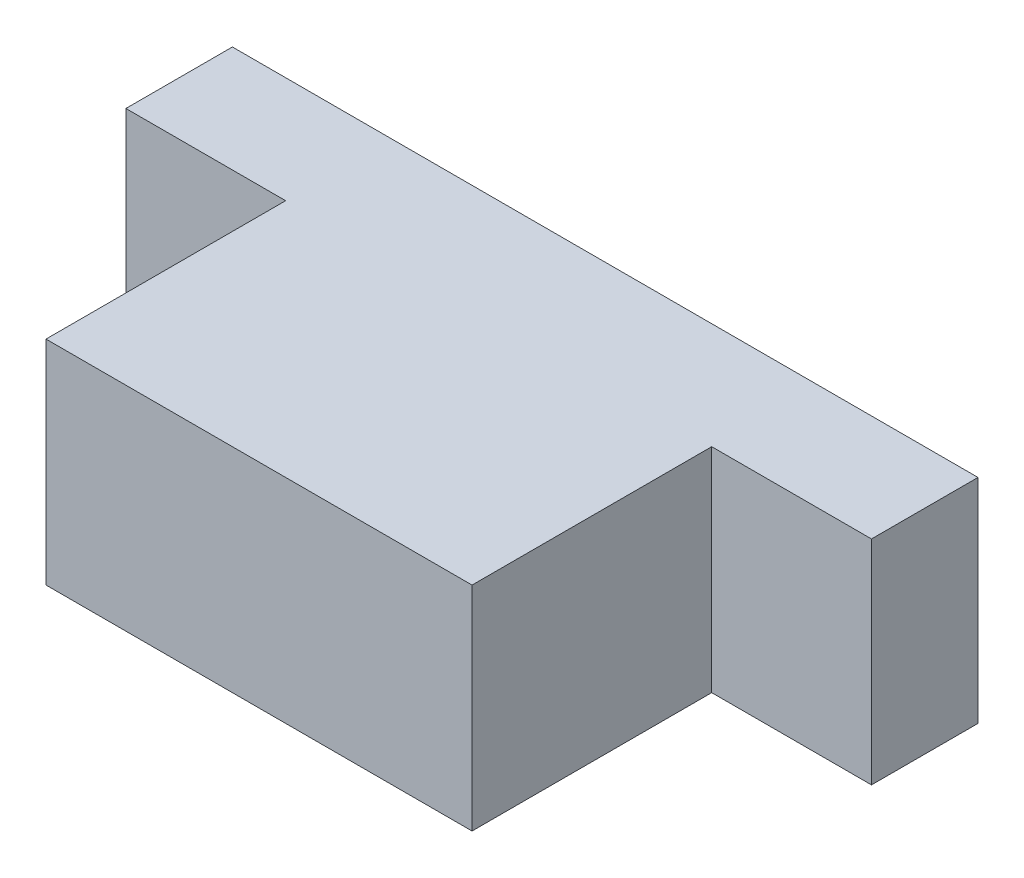
ISO-10303-21;
HEADER;
FILE_DESCRIPTION(('STEP AP214'),'2;1');
FILE_NAME('part.step','',(''),(''),'','','');
FILE_SCHEMA(('AUTOMOTIVE_DESIGN { 1 0 10303 214 1 1 1 1 }'));
ENDSEC;
DATA;
#1=APPLICATION_CONTEXT('core data for automotive mechanical design processes');
#2=APPLICATION_PROTOCOL_DEFINITION('international standard','automotive_design',2000,#1);
#3=PRODUCT_CONTEXT('',#1,'mechanical');
#4=PRODUCT('Part','Part','',(#3));
#5=PRODUCT_RELATED_PRODUCT_CATEGORY('part','',(#4));
#6=PRODUCT_DEFINITION_FORMATION('','',#4);
#7=PRODUCT_DEFINITION_CONTEXT('part definition',#1,'design');
#8=PRODUCT_DEFINITION('design','',#6,#7);
#9=PRODUCT_DEFINITION_SHAPE('','',#8);
#10=(LENGTH_UNIT() NAMED_UNIT(*) SI_UNIT(.MILLI.,.METRE.));
#11=(NAMED_UNIT(*) PLANE_ANGLE_UNIT() SI_UNIT($,.RADIAN.));
#12=(NAMED_UNIT(*) SI_UNIT($,.STERADIAN.) SOLID_ANGLE_UNIT());
#13=UNCERTAINTY_MEASURE_WITH_UNIT(LENGTH_MEASURE(1.E-05),#10,'distance_accuracy_value','');
#14=(GEOMETRIC_REPRESENTATION_CONTEXT(3) GLOBAL_UNCERTAINTY_ASSIGNED_CONTEXT((#13)) GLOBAL_UNIT_ASSIGNED_CONTEXT((#10,
#11,#12)) REPRESENTATION_CONTEXT('',''));
#15=CARTESIAN_POINT('',(0.,0.,0.));
#16=DIRECTION('',(0.,0.,1.));
#17=DIRECTION('',(1.,0.,0.));
#18=AXIS2_PLACEMENT_3D('',#15,#16,#17);
#19=CARTESIAN_POINT('',(20.,-10.,22.5));
#20=DIRECTION('',(-1.,0.,0.));
#21=DIRECTION('',(0.,0.,1.));
#22=AXIS2_PLACEMENT_3D('',#19,#20,#21);
#23=PLANE('',#22);
#24=DIRECTION('',(0.,1.,0.));
#25=VECTOR('',#24,1.);
#26=CARTESIAN_POINT('',(20.,-10.,0.));
#27=LINE('',#26,#25);
#28=CARTESIAN_POINT('',(20.,-10.,0.));
#29=VERTEX_POINT('',#28);
#30=CARTESIAN_POINT('',(20.,10.,0.));
#31=VERTEX_POINT('',#30);
#32=EDGE_CURVE('E122',#29,#31,#27,.T.);
#33=ORIENTED_EDGE('',*,*,#32,.T.);
#34=DIRECTION('',(0.,0.,-1.));
#35=VECTOR('',#34,1.);
#36=CARTESIAN_POINT('',(20.,10.,22.5));
#37=LINE('',#36,#35);
#38=CARTESIAN_POINT('',(20.,10.,22.5));
#39=VERTEX_POINT('',#38);
#40=EDGE_CURVE('E11',#39,#31,#37,.T.);
#41=ORIENTED_EDGE('',*,*,#40,.F.);
#42=DIRECTION('',(0.,1.,0.));
#43=VECTOR('',#42,1.);
#44=CARTESIAN_POINT('',(20.,-10.,22.5));
#45=LINE('',#44,#43);
#46=CARTESIAN_POINT('',(20.,-10.,22.5));
#47=VERTEX_POINT('',#46);
#48=EDGE_CURVE('E131',#47,#39,#45,.T.);
#49=ORIENTED_EDGE('',*,*,#48,.F.);
#50=DIRECTION('',(0.,0.,-1.));
#51=VECTOR('',#50,1.);
#52=CARTESIAN_POINT('',(20.,-10.,22.5));
#53=LINE('',#52,#51);
#54=EDGE_CURVE('E137',#47,#29,#53,.T.);
#55=ORIENTED_EDGE('',*,*,#54,.T.);
#56=EDGE_LOOP('',(#33,#41,#49,#55));
#57=FACE_BOUND('',#56,.T.);
#58=ADVANCED_FACE('F36',(#57),#23,.F.);
#59=CARTESIAN_POINT('',(-20.,10.,22.5));
#60=DIRECTION('',(0.,-1.,0.));
#61=DIRECTION('',(0.,0.,-1.));
#62=AXIS2_PLACEMENT_3D('',#59,#60,#61);
#63=PLANE('',#62);
#64=ORIENTED_EDGE('',*,*,#40,.T.);
#65=DIRECTION('',(1.,0.,0.));
#66=VECTOR('',#65,1.);
#67=CARTESIAN_POINT('',(35.,10.,0.));
#68=LINE('',#67,#66);
#69=CARTESIAN_POINT('',(35.,10.,0.));
#70=VERTEX_POINT('',#69);
#71=EDGE_CURVE('E154',#31,#70,#68,.T.);
#72=ORIENTED_EDGE('',*,*,#71,.T.);
#73=DIRECTION('',(0.,0.,1.));
#74=VECTOR('',#73,1.);
#75=CARTESIAN_POINT('',(35.,10.,-10.));
#76=LINE('',#75,#74);
#77=CARTESIAN_POINT('',(35.,10.,-10.));
#78=VERTEX_POINT('',#77);
#79=EDGE_CURVE('E104',#78,#70,#76,.T.);
#80=ORIENTED_EDGE('',*,*,#79,.F.);
#81=DIRECTION('',(1.,0.,0.));
#82=VECTOR('',#81,1.);
#83=CARTESIAN_POINT('',(35.,10.,-10.));
#84=LINE('',#83,#82);
#85=CARTESIAN_POINT('',(-35.,10.,-10.));
#86=VERTEX_POINT('',#85);
#87=EDGE_CURVE('E96',#86,#78,#84,.T.);
#88=ORIENTED_EDGE('',*,*,#87,.F.);
#89=DIRECTION('',(0.,0.,1.));
#90=VECTOR('',#89,1.);
#91=CARTESIAN_POINT('',(-35.,10.,-10.));
#92=LINE('',#91,#90);
#93=CARTESIAN_POINT('',(-35.,10.,0.));
#94=VERTEX_POINT('',#93);
#95=EDGE_CURVE('E101',#86,#94,#92,.T.);
#96=ORIENTED_EDGE('',*,*,#95,.T.);
#97=CARTESIAN_POINT('',(-20.,10.,0.));
#98=VERTEX_POINT('',#97);
#99=EDGE_CURVE('E151',#94,#98,#68,.T.);
#100=ORIENTED_EDGE('',*,*,#99,.T.);
#101=DIRECTION('',(0.,0.,-1.));
#102=VECTOR('',#101,1.);
#103=CARTESIAN_POINT('',(-20.,10.,22.5));
#104=LINE('',#103,#102);
#105=CARTESIAN_POINT('',(-20.,10.,22.5));
#106=VERTEX_POINT('',#105);
#107=EDGE_CURVE('E44',#106,#98,#104,.T.);
#108=ORIENTED_EDGE('',*,*,#107,.F.);
#109=DIRECTION('',(-1.,0.,0.));
#110=VECTOR('',#109,1.);
#111=CARTESIAN_POINT('',(-20.,10.,22.5));
#112=LINE('',#111,#110);
#113=EDGE_CURVE('E133',#39,#106,#112,.T.);
#114=ORIENTED_EDGE('',*,*,#113,.F.);
#115=EDGE_LOOP('',(#64,#72,#80,#88,#96,#100,#108,#114));
#116=FACE_BOUND('',#115,.T.);
#117=ADVANCED_FACE('F98',(#116),#63,.F.);
#118=CARTESIAN_POINT('',(-20.,-10.,22.5));
#119=DIRECTION('',(1.,0.,0.));
#120=DIRECTION('',(0.,0.,-1.));
#121=AXIS2_PLACEMENT_3D('',#118,#119,#120);
#122=PLANE('',#121);
#123=DIRECTION('',(0.,-1.,0.));
#124=VECTOR('',#123,1.);
#125=CARTESIAN_POINT('',(-20.,-10.,0.));
#126=LINE('',#125,#124);
#127=CARTESIAN_POINT('',(-20.,-10.,0.));
#128=VERTEX_POINT('',#127);
#129=EDGE_CURVE('E125',#98,#128,#126,.T.);
#130=ORIENTED_EDGE('',*,*,#129,.T.);
#131=DIRECTION('',(0.,0.,-1.));
#132=VECTOR('',#131,1.);
#133=CARTESIAN_POINT('',(-20.,-10.,22.5));
#134=LINE('',#133,#132);
#135=CARTESIAN_POINT('',(-20.,-10.,22.5));
#136=VERTEX_POINT('',#135);
#137=EDGE_CURVE('E143',#136,#128,#134,.T.);
#138=ORIENTED_EDGE('',*,*,#137,.F.);
#139=DIRECTION('',(0.,-1.,0.));
#140=VECTOR('',#139,1.);
#141=CARTESIAN_POINT('',(-20.,-10.,22.5));
#142=LINE('',#141,#140);
#143=EDGE_CURVE('E135',#106,#136,#142,.T.);
#144=ORIENTED_EDGE('',*,*,#143,.F.);
#145=ORIENTED_EDGE('',*,*,#107,.T.);
#146=EDGE_LOOP('',(#130,#138,#144,#145));
#147=FACE_BOUND('',#146,.T.);
#148=ADVANCED_FACE('F149',(#147),#122,.F.);
#149=CARTESIAN_POINT('',(-20.,-10.,22.5));
#150=DIRECTION('',(0.,1.,0.));
#151=DIRECTION('',(0.,0.,1.));
#152=AXIS2_PLACEMENT_3D('',#149,#150,#151);
#153=PLANE('',#152);
#154=ORIENTED_EDGE('',*,*,#137,.T.);
#155=DIRECTION('',(-1.,0.,0.));
#156=VECTOR('',#155,1.);
#157=CARTESIAN_POINT('',(35.,-10.,0.));
#158=LINE('',#157,#156);
#159=CARTESIAN_POINT('',(-35.,-10.,0.));
#160=VERTEX_POINT('',#159);
#161=EDGE_CURVE('E156',#128,#160,#158,.T.);
#162=ORIENTED_EDGE('',*,*,#161,.T.);
#163=DIRECTION('',(0.,0.,1.));
#164=VECTOR('',#163,1.);
#165=CARTESIAN_POINT('',(-35.,-10.,-10.));
#166=LINE('',#165,#164);
#167=CARTESIAN_POINT('',(-35.,-10.,-10.));
#168=VERTEX_POINT('',#167);
#169=EDGE_CURVE('E163',#168,#160,#166,.T.);
#170=ORIENTED_EDGE('',*,*,#169,.F.);
#171=DIRECTION('',(-1.,0.,0.));
#172=VECTOR('',#171,1.);
#173=CARTESIAN_POINT('',(35.,-10.,-10.));
#174=LINE('',#173,#172);
#175=CARTESIAN_POINT('',(35.,-10.,-10.));
#176=VERTEX_POINT('',#175);
#177=EDGE_CURVE('E113',#176,#168,#174,.T.);
#178=ORIENTED_EDGE('',*,*,#177,.F.);
#179=DIRECTION('',(0.,0.,1.));
#180=VECTOR('',#179,1.);
#181=CARTESIAN_POINT('',(35.,-10.,-10.));
#182=LINE('',#181,#180);
#183=CARTESIAN_POINT('',(35.,-10.,0.));
#184=VERTEX_POINT('',#183);
#185=EDGE_CURVE('E127',#176,#184,#182,.T.);
#186=ORIENTED_EDGE('',*,*,#185,.T.);
#187=EDGE_CURVE('E117',#184,#29,#158,.T.);
#188=ORIENTED_EDGE('',*,*,#187,.T.);
#189=ORIENTED_EDGE('',*,*,#54,.F.);
#190=DIRECTION('',(1.,0.,0.));
#191=VECTOR('',#190,1.);
#192=CARTESIAN_POINT('',(-20.,-10.,22.5));
#193=LINE('',#192,#191);
#194=EDGE_CURVE('E51',#136,#47,#193,.T.);
#195=ORIENTED_EDGE('',*,*,#194,.F.);
#196=EDGE_LOOP('',(#154,#162,#170,#178,#186,#188,#189,#195));
#197=FACE_BOUND('',#196,.T.);
#198=ADVANCED_FACE('F168',(#197),#153,.F.);
#199=CARTESIAN_POINT('',(0.,0.,22.5));
#200=DIRECTION('',(0.,0.,-1.));
#201=DIRECTION('',(-1.,0.,0.));
#202=AXIS2_PLACEMENT_3D('',#199,#200,#201);
#203=PLANE('',#202);
#204=ORIENTED_EDGE('',*,*,#48,.T.);
#205=ORIENTED_EDGE('',*,*,#113,.T.);
#206=ORIENTED_EDGE('',*,*,#143,.T.);
#207=ORIENTED_EDGE('',*,*,#194,.T.);
#208=EDGE_LOOP('',(#204,#205,#206,#207));
#209=FACE_BOUND('',#208,.T.);
#210=ADVANCED_FACE('F186',(#209),#203,.F.);
#211=CARTESIAN_POINT('',(0.,0.,0.));
#212=DIRECTION('',(0.,0.,1.));
#213=DIRECTION('',(1.,0.,0.));
#214=AXIS2_PLACEMENT_3D('',#211,#212,#213);
#215=PLANE('',#214);
#216=ORIENTED_EDGE('',*,*,#32,.F.);
#217=ORIENTED_EDGE('',*,*,#187,.F.);
#218=DIRECTION('',(0.,-1.,0.));
#219=VECTOR('',#218,1.);
#220=CARTESIAN_POINT('',(35.,-10.,0.));
#221=LINE('',#220,#219);
#222=EDGE_CURVE('E153',#70,#184,#221,.T.);
#223=ORIENTED_EDGE('',*,*,#222,.F.);
#224=ORIENTED_EDGE('',*,*,#71,.F.);
#225=EDGE_LOOP('',(#216,#217,#223,#224));
#226=FACE_BOUND('',#225,.T.);
#227=ADVANCED_FACE('F172',(#226),#215,.T.);
#228=ORIENTED_EDGE('',*,*,#129,.F.);
#229=ORIENTED_EDGE('',*,*,#99,.F.);
#230=DIRECTION('',(0.,1.,0.));
#231=VECTOR('',#230,1.);
#232=CARTESIAN_POINT('',(-35.,-10.,0.));
#233=LINE('',#232,#231);
#234=EDGE_CURVE('E121',#160,#94,#233,.T.);
#235=ORIENTED_EDGE('',*,*,#234,.F.);
#236=ORIENTED_EDGE('',*,*,#161,.F.);
#237=EDGE_LOOP('',(#228,#229,#235,#236));
#238=FACE_BOUND('',#237,.T.);
#239=ADVANCED_FACE('F177',(#238),#215,.T.);
#240=CARTESIAN_POINT('',(-35.,-10.,-10.));
#241=DIRECTION('',(1.,0.,0.));
#242=DIRECTION('',(0.,0.,-1.));
#243=AXIS2_PLACEMENT_3D('',#240,#241,#242);
#244=PLANE('',#243);
#245=ORIENTED_EDGE('',*,*,#234,.T.);
#246=ORIENTED_EDGE('',*,*,#95,.F.);
#247=DIRECTION('',(0.,1.,0.));
#248=VECTOR('',#247,1.);
#249=CARTESIAN_POINT('',(-35.,-10.,-10.));
#250=LINE('',#249,#248);
#251=EDGE_CURVE('E108',#168,#86,#250,.T.);
#252=ORIENTED_EDGE('',*,*,#251,.F.);
#253=ORIENTED_EDGE('',*,*,#169,.T.);
#254=EDGE_LOOP('',(#245,#246,#252,#253));
#255=FACE_BOUND('',#254,.T.);
#256=ADVANCED_FACE('F119',(#255),#244,.F.);
#257=CARTESIAN_POINT('',(35.,-10.,-10.));
#258=DIRECTION('',(-1.,0.,0.));
#259=DIRECTION('',(0.,0.,1.));
#260=AXIS2_PLACEMENT_3D('',#257,#258,#259);
#261=PLANE('',#260);
#262=ORIENTED_EDGE('',*,*,#222,.T.);
#263=ORIENTED_EDGE('',*,*,#185,.F.);
#264=DIRECTION('',(0.,-1.,0.));
#265=VECTOR('',#264,1.);
#266=CARTESIAN_POINT('',(35.,-10.,-10.));
#267=LINE('',#266,#265);
#268=EDGE_CURVE('E107',#78,#176,#267,.T.);
#269=ORIENTED_EDGE('',*,*,#268,.F.);
#270=ORIENTED_EDGE('',*,*,#79,.T.);
#271=EDGE_LOOP('',(#262,#263,#269,#270));
#272=FACE_BOUND('',#271,.T.);
#273=ADVANCED_FACE('F184',(#272),#261,.F.);
#274=CARTESIAN_POINT('',(0.,0.,-10.));
#275=DIRECTION('',(0.,0.,1.));
#276=DIRECTION('',(1.,0.,0.));
#277=AXIS2_PLACEMENT_3D('',#274,#275,#276);
#278=PLANE('',#277);
#279=ORIENTED_EDGE('',*,*,#251,.T.);
#280=ORIENTED_EDGE('',*,*,#87,.T.);
#281=ORIENTED_EDGE('',*,*,#268,.T.);
#282=ORIENTED_EDGE('',*,*,#177,.T.);
#283=EDGE_LOOP('',(#279,#280,#281,#282));
#284=FACE_BOUND('',#283,.T.);
#285=ADVANCED_FACE('F111',(#284),#278,.F.);
#286=CLOSED_SHELL('',(#58,#117,#148,#198,#210,#227,#239,#256,#273,#285));
#287=MANIFOLD_SOLID_BREP('B2',#286);
#288=ADVANCED_BREP_SHAPE_REPRESENTATION('',(#18,#287),#14);
#289=SHAPE_DEFINITION_REPRESENTATION(#9,#288);
ENDSEC;
END-ISO-10303-21;
